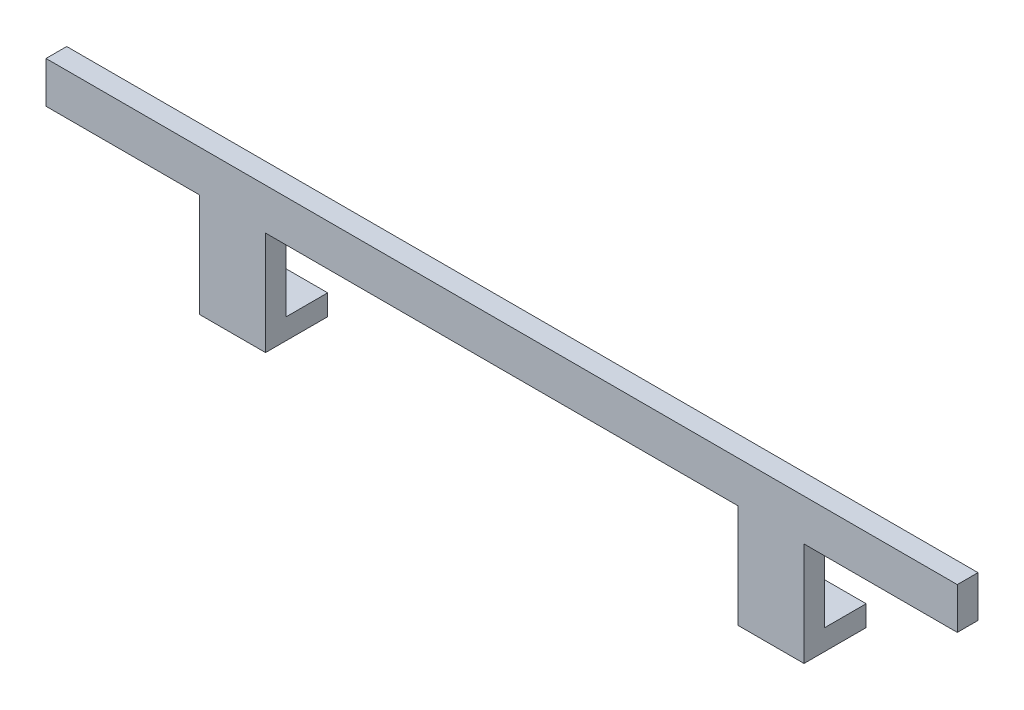
ISO-10303-21;
HEADER;
FILE_DESCRIPTION(('STEP AP214'),'2;1');
FILE_NAME('part.step','',(''),(''),'','','');
FILE_SCHEMA(('AUTOMOTIVE_DESIGN { 1 0 10303 214 1 1 1 1 }'));
ENDSEC;
DATA;
#1=APPLICATION_CONTEXT('core data for automotive mechanical design processes');
#2=APPLICATION_PROTOCOL_DEFINITION('international standard','automotive_design',2000,#1);
#3=PRODUCT_CONTEXT('',#1,'mechanical');
#4=PRODUCT('Part','Part','',(#3));
#5=PRODUCT_RELATED_PRODUCT_CATEGORY('part','',(#4));
#6=PRODUCT_DEFINITION_FORMATION('','',#4);
#7=PRODUCT_DEFINITION_CONTEXT('part definition',#1,'design');
#8=PRODUCT_DEFINITION('design','',#6,#7);
#9=PRODUCT_DEFINITION_SHAPE('','',#8);
#10=(LENGTH_UNIT() NAMED_UNIT(*) SI_UNIT(.MILLI.,.METRE.));
#11=(NAMED_UNIT(*) PLANE_ANGLE_UNIT() SI_UNIT($,.RADIAN.));
#12=(NAMED_UNIT(*) SI_UNIT($,.STERADIAN.) SOLID_ANGLE_UNIT());
#13=UNCERTAINTY_MEASURE_WITH_UNIT(LENGTH_MEASURE(1.E-05),#10,'distance_accuracy_value','');
#14=(GEOMETRIC_REPRESENTATION_CONTEXT(3) GLOBAL_UNCERTAINTY_ASSIGNED_CONTEXT((#13)) GLOBAL_UNIT_ASSIGNED_CONTEXT((#10,
#11,#12)) REPRESENTATION_CONTEXT('',''));
#15=CARTESIAN_POINT('',(0.,0.,0.));
#16=DIRECTION('',(0.,0.,1.));
#17=DIRECTION('',(1.,0.,0.));
#18=AXIS2_PLACEMENT_3D('',#15,#16,#17);
#19=CARTESIAN_POINT('',(0.,0.,0.));
#20=DIRECTION('',(0.,0.,1.));
#21=DIRECTION('',(1.,0.,0.));
#22=AXIS2_PLACEMENT_3D('',#19,#20,#21);
#23=PLANE('',#22);
#24=DIRECTION('',(1.,0.,0.));
#25=VECTOR('',#24,1.);
#26=CARTESIAN_POINT('',(57.,5.,0.));
#27=LINE('',#26,#25);
#28=CARTESIAN_POINT('',(57.,5.,0.));
#29=VERTEX_POINT('',#28);
#30=CARTESIAN_POINT('',(73.,5.,0.));
#31=VERTEX_POINT('',#30);
#32=EDGE_CURVE('E170',#29,#31,#27,.T.);
#33=ORIENTED_EDGE('',*,*,#32,.F.);
#34=DIRECTION('',(0.,-1.,0.));
#35=VECTOR('',#34,1.);
#36=CARTESIAN_POINT('',(57.,0.,0.));
#37=LINE('',#36,#35);
#38=CARTESIAN_POINT('',(57.,25.,0.));
#39=VERTEX_POINT('',#38);
#40=EDGE_CURVE('E237',#39,#29,#37,.T.);
#41=ORIENTED_EDGE('',*,*,#40,.F.);
#42=DIRECTION('',(1.,0.,0.));
#43=VECTOR('',#42,1.);
#44=CARTESIAN_POINT('',(-57.,25.,0.));
#45=LINE('',#44,#43);
#46=CARTESIAN_POINT('',(-57.,25.,0.));
#47=VERTEX_POINT('',#46);
#48=EDGE_CURVE('E235',#47,#39,#45,.T.);
#49=ORIENTED_EDGE('',*,*,#48,.F.);
#50=DIRECTION('',(0.,1.,0.));
#51=VECTOR('',#50,1.);
#52=CARTESIAN_POINT('',(-57.,0.,0.));
#53=LINE('',#52,#51);
#54=CARTESIAN_POINT('',(-57.,5.,0.));
#55=VERTEX_POINT('',#54);
#56=EDGE_CURVE('E233',#55,#47,#53,.T.);
#57=ORIENTED_EDGE('',*,*,#56,.F.);
#58=DIRECTION('',(1.,0.,0.));
#59=VECTOR('',#58,1.);
#60=CARTESIAN_POINT('',(-73.,5.,0.));
#61=LINE('',#60,#59);
#62=CARTESIAN_POINT('',(-73.,5.,0.));
#63=VERTEX_POINT('',#62);
#64=EDGE_CURVE('E56',#63,#55,#61,.T.);
#65=ORIENTED_EDGE('',*,*,#64,.F.);
#66=DIRECTION('',(0.,-1.,0.));
#67=VECTOR('',#66,1.);
#68=CARTESIAN_POINT('',(-73.,0.,0.));
#69=LINE('',#68,#67);
#70=CARTESIAN_POINT('',(-73.,25.,0.));
#71=VERTEX_POINT('',#70);
#72=EDGE_CURVE('E231',#71,#63,#69,.T.);
#73=ORIENTED_EDGE('',*,*,#72,.F.);
#74=DIRECTION('',(1.,0.,0.));
#75=VECTOR('',#74,1.);
#76=CARTESIAN_POINT('',(-110.,25.,0.));
#77=LINE('',#76,#75);
#78=CARTESIAN_POINT('',(-110.,25.,0.));
#79=VERTEX_POINT('',#78);
#80=EDGE_CURVE('E229',#79,#71,#77,.T.);
#81=ORIENTED_EDGE('',*,*,#80,.F.);
#82=DIRECTION('',(0.,-1.,0.));
#83=VECTOR('',#82,1.);
#84=CARTESIAN_POINT('',(-110.,35.,0.));
#85=LINE('',#84,#83);
#86=CARTESIAN_POINT('',(-110.,35.,0.));
#87=VERTEX_POINT('',#86);
#88=EDGE_CURVE('E200',#87,#79,#85,.T.);
#89=ORIENTED_EDGE('',*,*,#88,.F.);
#90=DIRECTION('',(-1.,0.,0.));
#91=VECTOR('',#90,1.);
#92=CARTESIAN_POINT('',(-110.,35.,0.));
#93=LINE('',#92,#91);
#94=CARTESIAN_POINT('',(110.,35.,0.));
#95=VERTEX_POINT('',#94);
#96=EDGE_CURVE('E205',#95,#87,#93,.T.);
#97=ORIENTED_EDGE('',*,*,#96,.F.);
#98=DIRECTION('',(0.,1.,0.));
#99=VECTOR('',#98,1.);
#100=CARTESIAN_POINT('',(110.,35.,0.));
#101=LINE('',#100,#99);
#102=CARTESIAN_POINT('',(110.,25.,0.));
#103=VERTEX_POINT('',#102);
#104=EDGE_CURVE('E244',#103,#95,#101,.T.);
#105=ORIENTED_EDGE('',*,*,#104,.F.);
#106=DIRECTION('',(1.,0.,0.));
#107=VECTOR('',#106,1.);
#108=CARTESIAN_POINT('',(73.,25.,0.));
#109=LINE('',#108,#107);
#110=CARTESIAN_POINT('',(73.,25.,0.));
#111=VERTEX_POINT('',#110);
#112=EDGE_CURVE('E242',#111,#103,#109,.T.);
#113=ORIENTED_EDGE('',*,*,#112,.F.);
#114=DIRECTION('',(0.,1.,0.));
#115=VECTOR('',#114,1.);
#116=CARTESIAN_POINT('',(73.,0.,0.));
#117=LINE('',#116,#115);
#118=EDGE_CURVE('E240',#31,#111,#117,.T.);
#119=ORIENTED_EDGE('',*,*,#118,.F.);
#120=EDGE_LOOP('',(#33,#41,#49,#57,#65,#73,#81,#89,#97,#105,#113,#119));
#121=FACE_BOUND('',#120,.T.);
#122=ADVANCED_FACE('F33',(#121),#23,.F.);
#123=CARTESIAN_POINT('',(-110.,35.,5.));
#124=DIRECTION('',(1.,0.,0.));
#125=DIRECTION('',(0.,0.,-1.));
#126=AXIS2_PLACEMENT_3D('',#123,#124,#125);
#127=PLANE('',#126);
#128=ORIENTED_EDGE('',*,*,#88,.T.);
#129=DIRECTION('',(0.,0.,-1.));
#130=VECTOR('',#129,1.);
#131=CARTESIAN_POINT('',(-110.,25.,5.));
#132=LINE('',#131,#130);
#133=CARTESIAN_POINT('',(-110.,25.,5.));
#134=VERTEX_POINT('',#133);
#135=EDGE_CURVE('E11',#134,#79,#132,.T.);
#136=ORIENTED_EDGE('',*,*,#135,.F.);
#137=DIRECTION('',(0.,-1.,0.));
#138=VECTOR('',#137,1.);
#139=CARTESIAN_POINT('',(-110.,35.,5.));
#140=LINE('',#139,#138);
#141=CARTESIAN_POINT('',(-110.,35.,5.));
#142=VERTEX_POINT('',#141);
#143=EDGE_CURVE('E201',#142,#134,#140,.T.);
#144=ORIENTED_EDGE('',*,*,#143,.F.);
#145=DIRECTION('',(0.,0.,-1.));
#146=VECTOR('',#145,1.);
#147=CARTESIAN_POINT('',(-110.,35.,5.));
#148=LINE('',#147,#146);
#149=EDGE_CURVE('E226',#142,#87,#148,.T.);
#150=ORIENTED_EDGE('',*,*,#149,.T.);
#151=EDGE_LOOP('',(#128,#136,#144,#150));
#152=FACE_BOUND('',#151,.T.);
#153=ADVANCED_FACE('F35',(#152),#127,.F.);
#154=CARTESIAN_POINT('',(-110.,25.,5.));
#155=DIRECTION('',(0.,1.,0.));
#156=DIRECTION('',(-1.,0.,0.));
#157=AXIS2_PLACEMENT_3D('',#154,#155,#156);
#158=PLANE('',#157);
#159=ORIENTED_EDGE('',*,*,#80,.T.);
#160=DIRECTION('',(0.,0.,-1.));
#161=VECTOR('',#160,1.);
#162=CARTESIAN_POINT('',(-73.,25.,5.));
#163=LINE('',#162,#161);
#164=CARTESIAN_POINT('',(-73.,25.,5.));
#165=VERTEX_POINT('',#164);
#166=EDGE_CURVE('E41',#165,#71,#163,.T.);
#167=ORIENTED_EDGE('',*,*,#166,.F.);
#168=DIRECTION('',(1.,0.,0.));
#169=VECTOR('',#168,1.);
#170=CARTESIAN_POINT('',(-110.,25.,5.));
#171=LINE('',#170,#169);
#172=EDGE_CURVE('E204',#134,#165,#171,.T.);
#173=ORIENTED_EDGE('',*,*,#172,.F.);
#174=ORIENTED_EDGE('',*,*,#135,.T.);
#175=EDGE_LOOP('',(#159,#167,#173,#174));
#176=FACE_BOUND('',#175,.T.);
#177=ADVANCED_FACE('F279',(#176),#158,.F.);
#178=CARTESIAN_POINT('',(-73.,0.,5.));
#179=DIRECTION('',(1.,0.,0.));
#180=DIRECTION('',(0.,0.,-1.));
#181=AXIS2_PLACEMENT_3D('',#178,#179,#180);
#182=PLANE('',#181);
#183=ORIENTED_EDGE('',*,*,#72,.T.);
#184=DIRECTION('',(0.,0.,1.));
#185=VECTOR('',#184,1.);
#186=CARTESIAN_POINT('',(-73.,5.,-10.));
#187=LINE('',#186,#185);
#188=CARTESIAN_POINT('',(-73.,5.,-10.));
#189=VERTEX_POINT('',#188);
#190=EDGE_CURVE('E197',#189,#63,#187,.T.);
#191=ORIENTED_EDGE('',*,*,#190,.F.);
#192=DIRECTION('',(0.,1.,0.));
#193=VECTOR('',#192,1.);
#194=CARTESIAN_POINT('',(-73.,0.,-10.));
#195=LINE('',#194,#193);
#196=CARTESIAN_POINT('',(-73.,0.,-10.));
#197=VERTEX_POINT('',#196);
#198=EDGE_CURVE('E186',#197,#189,#195,.T.);
#199=ORIENTED_EDGE('',*,*,#198,.F.);
#200=DIRECTION('',(0.,0.,-1.));
#201=VECTOR('',#200,1.);
#202=CARTESIAN_POINT('',(-73.,0.,5.));
#203=LINE('',#202,#201);
#204=CARTESIAN_POINT('',(-73.,0.,5.));
#205=VERTEX_POINT('',#204);
#206=EDGE_CURVE('E266',#205,#197,#203,.T.);
#207=ORIENTED_EDGE('',*,*,#206,.F.);
#208=DIRECTION('',(0.,-1.,0.));
#209=VECTOR('',#208,1.);
#210=CARTESIAN_POINT('',(-73.,0.,5.));
#211=LINE('',#210,#209);
#212=EDGE_CURVE('E207',#165,#205,#211,.T.);
#213=ORIENTED_EDGE('',*,*,#212,.F.);
#214=ORIENTED_EDGE('',*,*,#166,.T.);
#215=EDGE_LOOP('',(#183,#191,#199,#207,#213,#214));
#216=FACE_BOUND('',#215,.T.);
#217=ADVANCED_FACE('F271',(#216),#182,.F.);
#218=CARTESIAN_POINT('',(-73.,0.,5.));
#219=DIRECTION('',(0.,1.,0.));
#220=DIRECTION('',(0.,0.,1.));
#221=AXIS2_PLACEMENT_3D('',#218,#219,#220);
#222=PLANE('',#221);
#223=CARTESIAN_POINT('',(-65.,0.,-5.));
#224=DIRECTION('',(0.,1.,0.));
#225=DIRECTION('',(0.,0.,1.));
#226=AXIS2_PLACEMENT_3D('',#223,#224,#225);
#227=CIRCLE('',#226,2.);
#228=CARTESIAN_POINT('',(-65.,0.,-3.));
#229=VERTEX_POINT('',#228);
#230=EDGE_CURVE('E175',#229,#229,#227,.F.);
#231=ORIENTED_EDGE('',*,*,#230,.F.);
#232=EDGE_LOOP('',(#231));
#233=FACE_BOUND('',#232,.T.);
#234=ORIENTED_EDGE('',*,*,#206,.T.);
#235=DIRECTION('',(-1.,0.,0.));
#236=VECTOR('',#235,1.);
#237=CARTESIAN_POINT('',(-57.,0.,-10.));
#238=LINE('',#237,#236);
#239=CARTESIAN_POINT('',(-57.,0.,-10.));
#240=VERTEX_POINT('',#239);
#241=EDGE_CURVE('E183',#240,#197,#238,.T.);
#242=ORIENTED_EDGE('',*,*,#241,.F.);
#243=DIRECTION('',(0.,0.,-1.));
#244=VECTOR('',#243,1.);
#245=CARTESIAN_POINT('',(-57.,0.,5.));
#246=LINE('',#245,#244);
#247=CARTESIAN_POINT('',(-57.,0.,5.));
#248=VERTEX_POINT('',#247);
#249=EDGE_CURVE('E264',#248,#240,#246,.T.);
#250=ORIENTED_EDGE('',*,*,#249,.F.);
#251=DIRECTION('',(1.,0.,0.));
#252=VECTOR('',#251,1.);
#253=CARTESIAN_POINT('',(-73.,0.,5.));
#254=LINE('',#253,#252);
#255=EDGE_CURVE('E209',#205,#248,#254,.T.);
#256=ORIENTED_EDGE('',*,*,#255,.F.);
#257=EDGE_LOOP('',(#234,#242,#250,#256));
#258=FACE_BOUND('',#257,.T.);
#259=ADVANCED_FACE('F322',(#233,#258),#222,.F.);
#260=CARTESIAN_POINT('',(-57.,0.,5.));
#261=DIRECTION('',(-1.,0.,0.));
#262=DIRECTION('',(0.,-1.,0.));
#263=AXIS2_PLACEMENT_3D('',#260,#261,#262);
#264=PLANE('',#263);
#265=ORIENTED_EDGE('',*,*,#249,.T.);
#266=DIRECTION('',(0.,-1.,0.));
#267=VECTOR('',#266,1.);
#268=CARTESIAN_POINT('',(-57.,0.,-10.));
#269=LINE('',#268,#267);
#270=CARTESIAN_POINT('',(-57.,5.,-10.));
#271=VERTEX_POINT('',#270);
#272=EDGE_CURVE('E190',#271,#240,#269,.T.);
#273=ORIENTED_EDGE('',*,*,#272,.F.);
#274=DIRECTION('',(0.,0.,1.));
#275=VECTOR('',#274,1.);
#276=CARTESIAN_POINT('',(-57.,5.,-10.));
#277=LINE('',#276,#275);
#278=EDGE_CURVE('E193',#271,#55,#277,.T.);
#279=ORIENTED_EDGE('',*,*,#278,.T.);
#280=ORIENTED_EDGE('',*,*,#56,.T.);
#281=DIRECTION('',(0.,0.,-1.));
#282=VECTOR('',#281,1.);
#283=CARTESIAN_POINT('',(-57.,25.,5.));
#284=LINE('',#283,#282);
#285=CARTESIAN_POINT('',(-57.,25.,5.));
#286=VERTEX_POINT('',#285);
#287=EDGE_CURVE('E261',#286,#47,#284,.T.);
#288=ORIENTED_EDGE('',*,*,#287,.F.);
#289=DIRECTION('',(0.,1.,0.));
#290=VECTOR('',#289,1.);
#291=CARTESIAN_POINT('',(-57.,0.,5.));
#292=LINE('',#291,#290);
#293=EDGE_CURVE('E211',#248,#286,#292,.T.);
#294=ORIENTED_EDGE('',*,*,#293,.F.);
#295=EDGE_LOOP('',(#265,#273,#279,#280,#288,#294));
#296=FACE_BOUND('',#295,.T.);
#297=ADVANCED_FACE('F315',(#296),#264,.F.);
#298=CARTESIAN_POINT('',(-57.,25.,5.));
#299=DIRECTION('',(0.,1.,0.));
#300=DIRECTION('',(0.,0.,1.));
#301=AXIS2_PLACEMENT_3D('',#298,#299,#300);
#302=PLANE('',#301);
#303=ORIENTED_EDGE('',*,*,#48,.T.);
#304=DIRECTION('',(0.,0.,-1.));
#305=VECTOR('',#304,1.);
#306=CARTESIAN_POINT('',(57.,25.,5.));
#307=LINE('',#306,#305);
#308=CARTESIAN_POINT('',(57.,25.,5.));
#309=VERTEX_POINT('',#308);
#310=EDGE_CURVE('E258',#309,#39,#307,.T.);
#311=ORIENTED_EDGE('',*,*,#310,.F.);
#312=DIRECTION('',(1.,0.,0.));
#313=VECTOR('',#312,1.);
#314=CARTESIAN_POINT('',(-57.,25.,5.));
#315=LINE('',#314,#313);
#316=EDGE_CURVE('E213',#286,#309,#315,.T.);
#317=ORIENTED_EDGE('',*,*,#316,.F.);
#318=ORIENTED_EDGE('',*,*,#287,.T.);
#319=EDGE_LOOP('',(#303,#311,#317,#318));
#320=FACE_BOUND('',#319,.T.);
#321=ADVANCED_FACE('F307',(#320),#302,.F.);
#322=CARTESIAN_POINT('',(57.,0.,5.));
#323=DIRECTION('',(1.,0.,0.));
#324=DIRECTION('',(0.,1.,0.));
#325=AXIS2_PLACEMENT_3D('',#322,#323,#324);
#326=PLANE('',#325);
#327=ORIENTED_EDGE('',*,*,#40,.T.);
#328=DIRECTION('',(0.,0.,1.));
#329=VECTOR('',#328,1.);
#330=CARTESIAN_POINT('',(57.,5.,-10.));
#331=LINE('',#330,#329);
#332=CARTESIAN_POINT('',(57.,5.,-10.));
#333=VERTEX_POINT('',#332);
#334=EDGE_CURVE('E181',#333,#29,#331,.T.);
#335=ORIENTED_EDGE('',*,*,#334,.F.);
#336=DIRECTION('',(0.,1.,0.));
#337=VECTOR('',#336,1.);
#338=CARTESIAN_POINT('',(57.,0.,-10.));
#339=LINE('',#338,#337);
#340=CARTESIAN_POINT('',(57.,0.,-10.));
#341=VERTEX_POINT('',#340);
#342=EDGE_CURVE('E165',#341,#333,#339,.T.);
#343=ORIENTED_EDGE('',*,*,#342,.F.);
#344=DIRECTION('',(0.,0.,-1.));
#345=VECTOR('',#344,1.);
#346=CARTESIAN_POINT('',(57.,0.,5.));
#347=LINE('',#346,#345);
#348=CARTESIAN_POINT('',(57.,0.,5.));
#349=VERTEX_POINT('',#348);
#350=EDGE_CURVE('E156',#349,#341,#347,.T.);
#351=ORIENTED_EDGE('',*,*,#350,.F.);
#352=DIRECTION('',(0.,-1.,0.));
#353=VECTOR('',#352,1.);
#354=CARTESIAN_POINT('',(57.,0.,5.));
#355=LINE('',#354,#353);
#356=EDGE_CURVE('E215',#309,#349,#355,.T.);
#357=ORIENTED_EDGE('',*,*,#356,.F.);
#358=ORIENTED_EDGE('',*,*,#310,.T.);
#359=EDGE_LOOP('',(#327,#335,#343,#351,#357,#358));
#360=FACE_BOUND('',#359,.T.);
#361=ADVANCED_FACE('F302',(#360),#326,.F.);
#362=CARTESIAN_POINT('',(57.,0.,5.));
#363=DIRECTION('',(0.,1.,0.));
#364=DIRECTION('',(0.,0.,1.));
#365=AXIS2_PLACEMENT_3D('',#362,#363,#364);
#366=PLANE('',#365);
#367=CARTESIAN_POINT('',(65.,0.,-5.));
#368=DIRECTION('',(0.,1.,0.));
#369=DIRECTION('',(0.,0.,1.));
#370=AXIS2_PLACEMENT_3D('',#367,#368,#369);
#371=CIRCLE('',#370,2.);
#372=CARTESIAN_POINT('',(65.,0.,-3.));
#373=VERTEX_POINT('',#372);
#374=EDGE_CURVE('E172',#373,#373,#371,.F.);
#375=ORIENTED_EDGE('',*,*,#374,.F.);
#376=EDGE_LOOP('',(#375));
#377=FACE_BOUND('',#376,.T.);
#378=ORIENTED_EDGE('',*,*,#350,.T.);
#379=DIRECTION('',(-1.,0.,0.));
#380=VECTOR('',#379,1.);
#381=CARTESIAN_POINT('',(73.,0.,-10.));
#382=LINE('',#381,#380);
#383=CARTESIAN_POINT('',(73.,0.,-10.));
#384=VERTEX_POINT('',#383);
#385=EDGE_CURVE('E160',#384,#341,#382,.T.);
#386=ORIENTED_EDGE('',*,*,#385,.F.);
#387=DIRECTION('',(0.,0.,-1.));
#388=VECTOR('',#387,1.);
#389=CARTESIAN_POINT('',(73.,0.,5.));
#390=LINE('',#389,#388);
#391=CARTESIAN_POINT('',(73.,0.,5.));
#392=VERTEX_POINT('',#391);
#393=EDGE_CURVE('E147',#392,#384,#390,.T.);
#394=ORIENTED_EDGE('',*,*,#393,.F.);
#395=DIRECTION('',(1.,0.,0.));
#396=VECTOR('',#395,1.);
#397=CARTESIAN_POINT('',(57.,0.,5.));
#398=LINE('',#397,#396);
#399=EDGE_CURVE('E217',#349,#392,#398,.T.);
#400=ORIENTED_EDGE('',*,*,#399,.F.);
#401=EDGE_LOOP('',(#378,#386,#394,#400));
#402=FACE_BOUND('',#401,.T.);
#403=ADVANCED_FACE('F161',(#377,#402),#366,.F.);
#404=CARTESIAN_POINT('',(73.,0.,5.));
#405=DIRECTION('',(-1.,0.,0.));
#406=DIRECTION('',(0.,0.,1.));
#407=AXIS2_PLACEMENT_3D('',#404,#405,#406);
#408=PLANE('',#407);
#409=ORIENTED_EDGE('',*,*,#393,.T.);
#410=DIRECTION('',(0.,-1.,0.));
#411=VECTOR('',#410,1.);
#412=CARTESIAN_POINT('',(73.,0.,-10.));
#413=LINE('',#412,#411);
#414=CARTESIAN_POINT('',(73.,5.,-10.));
#415=VERTEX_POINT('',#414);
#416=EDGE_CURVE('E151',#415,#384,#413,.T.);
#417=ORIENTED_EDGE('',*,*,#416,.F.);
#418=DIRECTION('',(0.,0.,1.));
#419=VECTOR('',#418,1.);
#420=CARTESIAN_POINT('',(73.,5.,-10.));
#421=LINE('',#420,#419);
#422=EDGE_CURVE('E48',#415,#31,#421,.T.);
#423=ORIENTED_EDGE('',*,*,#422,.T.);
#424=ORIENTED_EDGE('',*,*,#118,.T.);
#425=DIRECTION('',(0.,0.,-1.));
#426=VECTOR('',#425,1.);
#427=CARTESIAN_POINT('',(73.,25.,5.));
#428=LINE('',#427,#426);
#429=CARTESIAN_POINT('',(73.,25.,5.));
#430=VERTEX_POINT('',#429);
#431=EDGE_CURVE('E157',#430,#111,#428,.T.);
#432=ORIENTED_EDGE('',*,*,#431,.F.);
#433=DIRECTION('',(0.,1.,0.));
#434=VECTOR('',#433,1.);
#435=CARTESIAN_POINT('',(73.,0.,5.));
#436=LINE('',#435,#434);
#437=EDGE_CURVE('E153',#392,#430,#436,.T.);
#438=ORIENTED_EDGE('',*,*,#437,.F.);
#439=EDGE_LOOP('',(#409,#417,#423,#424,#432,#438));
#440=FACE_BOUND('',#439,.T.);
#441=ADVANCED_FACE('F149',(#440),#408,.F.);
#442=CARTESIAN_POINT('',(73.,25.,5.));
#443=DIRECTION('',(0.,1.,0.));
#444=DIRECTION('',(0.,0.,1.));
#445=AXIS2_PLACEMENT_3D('',#442,#443,#444);
#446=PLANE('',#445);
#447=ORIENTED_EDGE('',*,*,#112,.T.);
#448=DIRECTION('',(0.,0.,-1.));
#449=VECTOR('',#448,1.);
#450=CARTESIAN_POINT('',(110.,25.,5.));
#451=LINE('',#450,#449);
#452=CARTESIAN_POINT('',(110.,25.,5.));
#453=VERTEX_POINT('',#452);
#454=EDGE_CURVE('E252',#453,#103,#451,.T.);
#455=ORIENTED_EDGE('',*,*,#454,.F.);
#456=DIRECTION('',(1.,0.,0.));
#457=VECTOR('',#456,1.);
#458=CARTESIAN_POINT('',(73.,25.,5.));
#459=LINE('',#458,#457);
#460=EDGE_CURVE('E220',#430,#453,#459,.T.);
#461=ORIENTED_EDGE('',*,*,#460,.F.);
#462=ORIENTED_EDGE('',*,*,#431,.T.);
#463=EDGE_LOOP('',(#447,#455,#461,#462));
#464=FACE_BOUND('',#463,.T.);
#465=ADVANCED_FACE('F296',(#464),#446,.F.);
#466=CARTESIAN_POINT('',(110.,35.,5.));
#467=DIRECTION('',(-1.,0.,0.));
#468=DIRECTION('',(0.,0.,1.));
#469=AXIS2_PLACEMENT_3D('',#466,#467,#468);
#470=PLANE('',#469);
#471=ORIENTED_EDGE('',*,*,#104,.T.);
#472=DIRECTION('',(0.,0.,-1.));
#473=VECTOR('',#472,1.);
#474=CARTESIAN_POINT('',(110.,35.,5.));
#475=LINE('',#474,#473);
#476=CARTESIAN_POINT('',(110.,35.,5.));
#477=VERTEX_POINT('',#476);
#478=EDGE_CURVE('E249',#477,#95,#475,.T.);
#479=ORIENTED_EDGE('',*,*,#478,.F.);
#480=DIRECTION('',(0.,1.,0.));
#481=VECTOR('',#480,1.);
#482=CARTESIAN_POINT('',(110.,35.,5.));
#483=LINE('',#482,#481);
#484=EDGE_CURVE('E222',#453,#477,#483,.T.);
#485=ORIENTED_EDGE('',*,*,#484,.F.);
#486=ORIENTED_EDGE('',*,*,#454,.T.);
#487=EDGE_LOOP('',(#471,#479,#485,#486));
#488=FACE_BOUND('',#487,.T.);
#489=ADVANCED_FACE('F291',(#488),#470,.F.);
#490=CARTESIAN_POINT('',(-110.,35.,5.));
#491=DIRECTION('',(0.,-1.,0.));
#492=DIRECTION('',(0.,0.,-1.));
#493=AXIS2_PLACEMENT_3D('',#490,#491,#492);
#494=PLANE('',#493);
#495=ORIENTED_EDGE('',*,*,#96,.T.);
#496=ORIENTED_EDGE('',*,*,#149,.F.);
#497=DIRECTION('',(-1.,0.,0.));
#498=VECTOR('',#497,1.);
#499=CARTESIAN_POINT('',(-110.,35.,5.));
#500=LINE('',#499,#498);
#501=EDGE_CURVE('E224',#477,#142,#500,.T.);
#502=ORIENTED_EDGE('',*,*,#501,.F.);
#503=ORIENTED_EDGE('',*,*,#478,.T.);
#504=EDGE_LOOP('',(#495,#496,#502,#503));
#505=FACE_BOUND('',#504,.T.);
#506=ADVANCED_FACE('F285',(#505),#494,.F.);
#507=CARTESIAN_POINT('',(0.,0.,5.));
#508=DIRECTION('',(0.,0.,1.));
#509=DIRECTION('',(1.,0.,0.));
#510=AXIS2_PLACEMENT_3D('',#507,#508,#509);
#511=PLANE('',#510);
#512=ORIENTED_EDGE('',*,*,#143,.T.);
#513=ORIENTED_EDGE('',*,*,#172,.T.);
#514=ORIENTED_EDGE('',*,*,#212,.T.);
#515=ORIENTED_EDGE('',*,*,#255,.T.);
#516=ORIENTED_EDGE('',*,*,#293,.T.);
#517=ORIENTED_EDGE('',*,*,#316,.T.);
#518=ORIENTED_EDGE('',*,*,#356,.T.);
#519=ORIENTED_EDGE('',*,*,#399,.T.);
#520=ORIENTED_EDGE('',*,*,#437,.T.);
#521=ORIENTED_EDGE('',*,*,#460,.T.);
#522=ORIENTED_EDGE('',*,*,#484,.T.);
#523=ORIENTED_EDGE('',*,*,#501,.T.);
#524=EDGE_LOOP('',(#512,#513,#514,#515,#516,#517,#518,#519,#520,#521,#522,#523));
#525=FACE_BOUND('',#524,.T.);
#526=ADVANCED_FACE('F326',(#525),#511,.T.);
#527=CARTESIAN_POINT('',(-73.,5.,-10.));
#528=DIRECTION('',(0.,-1.,0.));
#529=DIRECTION('',(0.,0.,-1.));
#530=AXIS2_PLACEMENT_3D('',#527,#528,#529);
#531=PLANE('',#530);
#532=CARTESIAN_POINT('',(-65.,5.,-5.));
#533=DIRECTION('',(0.,1.,0.));
#534=DIRECTION('',(0.,0.,1.));
#535=AXIS2_PLACEMENT_3D('',#532,#533,#534);
#536=CIRCLE('',#535,2.);
#537=CARTESIAN_POINT('',(-65.,5.,-3.));
#538=VERTEX_POINT('',#537);
#539=EDGE_CURVE('E503',#538,#538,#536,.T.);
#540=ORIENTED_EDGE('',*,*,#539,.F.);
#541=EDGE_LOOP('',(#540));
#542=FACE_BOUND('',#541,.T.);
#543=ORIENTED_EDGE('',*,*,#64,.T.);
#544=ORIENTED_EDGE('',*,*,#278,.F.);
#545=DIRECTION('',(1.,0.,0.));
#546=VECTOR('',#545,1.);
#547=CARTESIAN_POINT('',(-73.,5.,-10.));
#548=LINE('',#547,#546);
#549=EDGE_CURVE('E188',#189,#271,#548,.T.);
#550=ORIENTED_EDGE('',*,*,#549,.F.);
#551=ORIENTED_EDGE('',*,*,#190,.T.);
#552=EDGE_LOOP('',(#543,#544,#550,#551));
#553=FACE_BOUND('',#552,.T.);
#554=ADVANCED_FACE('F312',(#542,#553),#531,.F.);
#555=CARTESIAN_POINT('',(0.,0.,-10.));
#556=DIRECTION('',(0.,0.,-1.));
#557=DIRECTION('',(-1.,0.,0.));
#558=AXIS2_PLACEMENT_3D('',#555,#556,#557);
#559=PLANE('',#558);
#560=ORIENTED_EDGE('',*,*,#241,.T.);
#561=ORIENTED_EDGE('',*,*,#198,.T.);
#562=ORIENTED_EDGE('',*,*,#549,.T.);
#563=ORIENTED_EDGE('',*,*,#272,.T.);
#564=EDGE_LOOP('',(#560,#561,#562,#563));
#565=FACE_BOUND('',#564,.T.);
#566=ADVANCED_FACE('F320',(#565),#559,.T.);
#567=CARTESIAN_POINT('',(57.,5.,-10.));
#568=DIRECTION('',(0.,-1.,0.));
#569=DIRECTION('',(0.,0.,-1.));
#570=AXIS2_PLACEMENT_3D('',#567,#568,#569);
#571=PLANE('',#570);
#572=CARTESIAN_POINT('',(65.,5.,-5.));
#573=DIRECTION('',(0.,1.,0.));
#574=DIRECTION('',(0.,0.,1.));
#575=AXIS2_PLACEMENT_3D('',#572,#573,#574);
#576=CIRCLE('',#575,2.);
#577=CARTESIAN_POINT('',(65.,5.,-3.));
#578=VERTEX_POINT('',#577);
#579=EDGE_CURVE('E506',#578,#578,#576,.T.);
#580=ORIENTED_EDGE('',*,*,#579,.F.);
#581=EDGE_LOOP('',(#580));
#582=FACE_BOUND('',#581,.T.);
#583=ORIENTED_EDGE('',*,*,#32,.T.);
#584=ORIENTED_EDGE('',*,*,#422,.F.);
#585=DIRECTION('',(1.,0.,0.));
#586=VECTOR('',#585,1.);
#587=CARTESIAN_POINT('',(57.,5.,-10.));
#588=LINE('',#587,#586);
#589=EDGE_CURVE('E169',#333,#415,#588,.T.);
#590=ORIENTED_EDGE('',*,*,#589,.F.);
#591=ORIENTED_EDGE('',*,*,#334,.T.);
#592=EDGE_LOOP('',(#583,#584,#590,#591));
#593=FACE_BOUND('',#592,.T.);
#594=ADVANCED_FACE('F461',(#582,#593),#571,.F.);
#595=CARTESIAN_POINT('',(0.,0.,-10.));
#596=DIRECTION('',(0.,0.,-1.));
#597=DIRECTION('',(-1.,0.,0.));
#598=AXIS2_PLACEMENT_3D('',#595,#596,#597);
#599=PLANE('',#598);
#600=ORIENTED_EDGE('',*,*,#416,.T.);
#601=ORIENTED_EDGE('',*,*,#385,.T.);
#602=ORIENTED_EDGE('',*,*,#342,.T.);
#603=ORIENTED_EDGE('',*,*,#589,.T.);
#604=EDGE_LOOP('',(#600,#601,#602,#603));
#605=FACE_BOUND('',#604,.T.);
#606=ADVANCED_FACE('F167',(#605),#599,.T.);
#607=CARTESIAN_POINT('',(65.,-0.00100000000000013,-5.));
#608=DIRECTION('',(0.,1.,0.));
#609=DIRECTION('',(0.,0.,1.));
#610=AXIS2_PLACEMENT_3D('',#607,#608,#609);
#611=CYLINDRICAL_SURFACE('',#610,2.);
#612=ORIENTED_EDGE('',*,*,#579,.T.);
#613=EDGE_LOOP('',(#612));
#614=FACE_BOUND('',#613,.T.);
#615=ORIENTED_EDGE('',*,*,#374,.T.);
#616=EDGE_LOOP('',(#615));
#617=FACE_BOUND('',#616,.T.);
#618=ADVANCED_FACE('F476',(#614,#617),#611,.F.);
#619=CARTESIAN_POINT('',(-65.,-0.00100000000000013,-5.));
#620=DIRECTION('',(0.,1.,0.));
#621=DIRECTION('',(0.,0.,1.));
#622=AXIS2_PLACEMENT_3D('',#619,#620,#621);
#623=CYLINDRICAL_SURFACE('',#622,2.);
#624=ORIENTED_EDGE('',*,*,#539,.T.);
#625=EDGE_LOOP('',(#624));
#626=FACE_BOUND('',#625,.T.);
#627=ORIENTED_EDGE('',*,*,#230,.T.);
#628=EDGE_LOOP('',(#627));
#629=FACE_BOUND('',#628,.T.);
#630=ADVANCED_FACE('F483',(#626,#629),#623,.F.);
#631=CLOSED_SHELL('',(#122,#153,#177,#217,#259,#297,#321,#361,#403,#441,#465,#489,#506,#526,
#554,#566,#594,#606,#618,#630));
#632=MANIFOLD_SOLID_BREP('B2',#631);
#633=ADVANCED_BREP_SHAPE_REPRESENTATION('',(#18,#632),#14);
#634=SHAPE_DEFINITION_REPRESENTATION(#9,#633);
ENDSEC;
END-ISO-10303-21;
